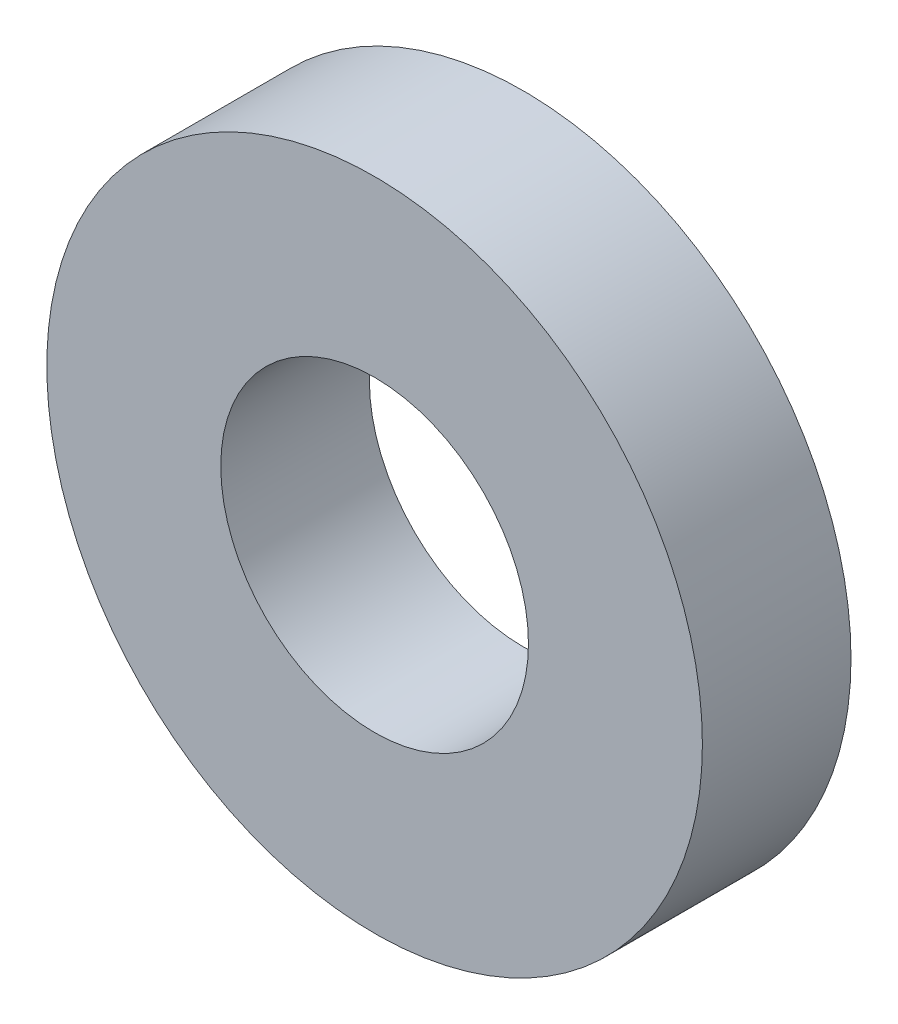
ISO-10303-21;
HEADER;
FILE_DESCRIPTION(('STEP AP214'),'2;1');
FILE_NAME('part.step','',(''),(''),'','','');
FILE_SCHEMA(('AUTOMOTIVE_DESIGN { 1 0 10303 214 1 1 1 1 }'));
ENDSEC;
DATA;
#1=APPLICATION_CONTEXT('core data for automotive mechanical design processes');
#2=APPLICATION_PROTOCOL_DEFINITION('international standard','automotive_design',2000,#1);
#3=PRODUCT_CONTEXT('',#1,'mechanical');
#4=PRODUCT('Part','Part','',(#3));
#5=PRODUCT_RELATED_PRODUCT_CATEGORY('part','',(#4));
#6=PRODUCT_DEFINITION_FORMATION('','',#4);
#7=PRODUCT_DEFINITION_CONTEXT('part definition',#1,'design');
#8=PRODUCT_DEFINITION('design','',#6,#7);
#9=PRODUCT_DEFINITION_SHAPE('','',#8);
#10=(LENGTH_UNIT() NAMED_UNIT(*) SI_UNIT(.MILLI.,.METRE.));
#11=(NAMED_UNIT(*) PLANE_ANGLE_UNIT() SI_UNIT($,.RADIAN.));
#12=(NAMED_UNIT(*) SI_UNIT($,.STERADIAN.) SOLID_ANGLE_UNIT());
#13=UNCERTAINTY_MEASURE_WITH_UNIT(LENGTH_MEASURE(1.E-05),#10,'distance_accuracy_value','');
#14=(GEOMETRIC_REPRESENTATION_CONTEXT(3) GLOBAL_UNCERTAINTY_ASSIGNED_CONTEXT((#13)) GLOBAL_UNIT_ASSIGNED_CONTEXT((#10,
#11,#12)) REPRESENTATION_CONTEXT('',''));
#15=CARTESIAN_POINT('',(0.,0.,0.));
#16=DIRECTION('',(0.,0.,1.));
#17=DIRECTION('',(1.,0.,0.));
#18=AXIS2_PLACEMENT_3D('',#15,#16,#17);
#19=CARTESIAN_POINT('',(0.,0.,8.5));
#20=DIRECTION('',(0.,0.,1.));
#21=DIRECTION('',(1.,0.,0.));
#22=AXIS2_PLACEMENT_3D('',#19,#20,#21);
#23=PLANE('',#22);
#24=CARTESIAN_POINT('',(0.,0.,8.5));
#25=DIRECTION('',(0.,0.,1.));
#26=DIRECTION('',(1.,0.,0.));
#27=AXIS2_PLACEMENT_3D('',#24,#25,#26);
#28=CIRCLE('',#27,37.5);
#29=CARTESIAN_POINT('',(37.5,0.,8.5));
#30=VERTEX_POINT('',#29);
#31=EDGE_CURVE('E10',#30,#30,#28,.T.);
#32=ORIENTED_EDGE('',*,*,#31,.T.);
#33=EDGE_LOOP('',(#32));
#34=FACE_BOUND('',#33,.T.);
#35=CARTESIAN_POINT('',(0.,0.,8.5));
#36=DIRECTION('',(0.,0.,1.));
#37=DIRECTION('',(1.,0.,0.));
#38=AXIS2_PLACEMENT_3D('',#35,#36,#37);
#39=CIRCLE('',#38,17.6);
#40=CARTESIAN_POINT('',(17.6,0.,8.5));
#41=VERTEX_POINT('',#40);
#42=EDGE_CURVE('E43',#41,#41,#39,.T.);
#43=ORIENTED_EDGE('',*,*,#42,.F.);
#44=EDGE_LOOP('',(#43));
#45=FACE_BOUND('',#44,.T.);
#46=ADVANCED_FACE('F32',(#34,#45),#23,.T.);
#47=CARTESIAN_POINT('',(0.,0.,-8.5));
#48=DIRECTION('',(0.,0.,1.));
#49=DIRECTION('',(1.,0.,0.));
#50=AXIS2_PLACEMENT_3D('',#47,#48,#49);
#51=PLANE('',#50);
#52=CARTESIAN_POINT('',(0.,0.,-8.5));
#53=DIRECTION('',(0.,0.,1.));
#54=DIRECTION('',(1.,0.,0.));
#55=AXIS2_PLACEMENT_3D('',#52,#53,#54);
#56=CIRCLE('',#55,37.5);
#57=CARTESIAN_POINT('',(37.5,0.,-8.5));
#58=VERTEX_POINT('',#57);
#59=EDGE_CURVE('E36',#58,#58,#56,.T.);
#60=ORIENTED_EDGE('',*,*,#59,.F.);
#61=EDGE_LOOP('',(#60));
#62=FACE_BOUND('',#61,.T.);
#63=CARTESIAN_POINT('',(0.,0.,-8.5));
#64=DIRECTION('',(0.,0.,1.));
#65=DIRECTION('',(1.,0.,0.));
#66=AXIS2_PLACEMENT_3D('',#63,#64,#65);
#67=CIRCLE('',#66,17.6);
#68=CARTESIAN_POINT('',(17.6,0.,-8.5));
#69=VERTEX_POINT('',#68);
#70=EDGE_CURVE('E45',#69,#69,#67,.T.);
#71=ORIENTED_EDGE('',*,*,#70,.T.);
#72=EDGE_LOOP('',(#71));
#73=FACE_BOUND('',#72,.T.);
#74=ADVANCED_FACE('F55',(#62,#73),#51,.F.);
#75=CARTESIAN_POINT('',(0.,0.,8.5));
#76=DIRECTION('',(0.,0.,-1.));
#77=DIRECTION('',(-1.,0.,0.));
#78=AXIS2_PLACEMENT_3D('',#75,#76,#77);
#79=CYLINDRICAL_SURFACE('',#78,37.5);
#80=ORIENTED_EDGE('',*,*,#31,.F.);
#81=EDGE_LOOP('',(#80));
#82=FACE_BOUND('',#81,.T.);
#83=ORIENTED_EDGE('',*,*,#59,.T.);
#84=EDGE_LOOP('',(#83));
#85=FACE_BOUND('',#84,.T.);
#86=ADVANCED_FACE('F34',(#82,#85),#79,.T.);
#87=CARTESIAN_POINT('',(0.,0.,8.5));
#88=DIRECTION('',(0.,0.,-1.));
#89=DIRECTION('',(-1.,0.,0.));
#90=AXIS2_PLACEMENT_3D('',#87,#88,#89);
#91=CYLINDRICAL_SURFACE('',#90,17.6);
#92=ORIENTED_EDGE('',*,*,#42,.T.);
#93=EDGE_LOOP('',(#92));
#94=FACE_BOUND('',#93,.T.);
#95=ORIENTED_EDGE('',*,*,#70,.F.);
#96=EDGE_LOOP('',(#95));
#97=FACE_BOUND('',#96,.T.);
#98=ADVANCED_FACE('F51',(#94,#97),#91,.F.);
#99=CLOSED_SHELL('',(#46,#74,#86,#98));
#100=MANIFOLD_SOLID_BREP('B2',#99);
#101=ADVANCED_BREP_SHAPE_REPRESENTATION('',(#18,#100),#14);
#102=SHAPE_DEFINITION_REPRESENTATION(#9,#101);
ENDSEC;
END-ISO-10303-21;
